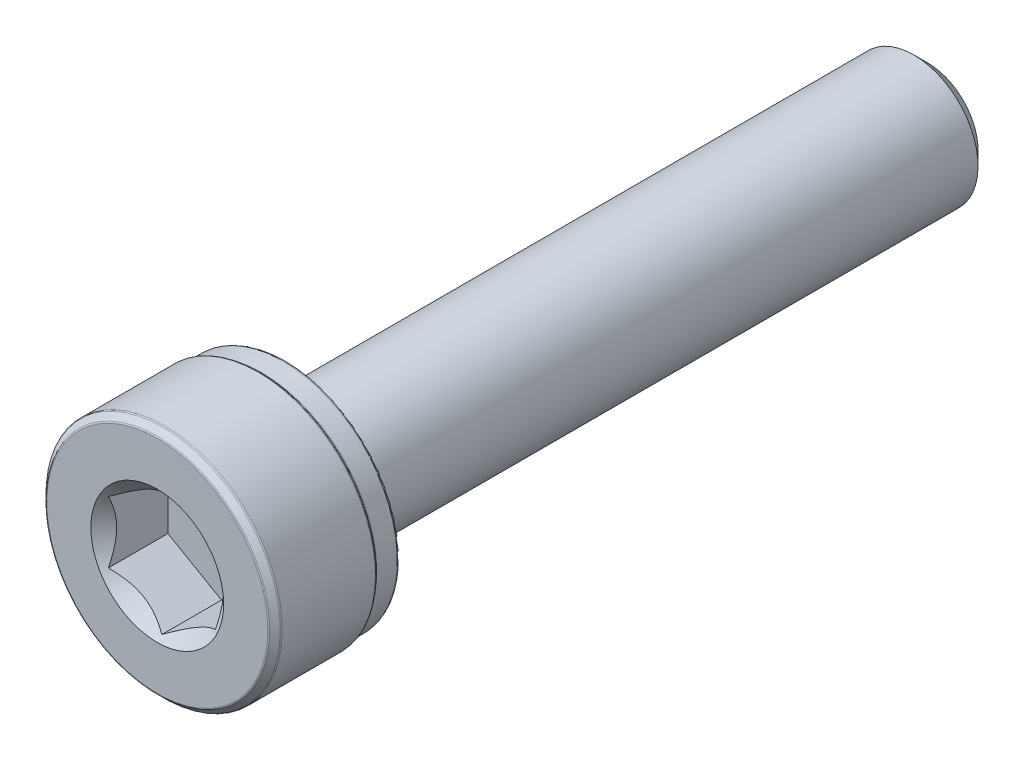
ISO-10303-21;
HEADER;
FILE_DESCRIPTION(('STEP AP214'),'2;1');
FILE_NAME('part.step','',(''),(''),'','','');
FILE_SCHEMA(('AUTOMOTIVE_DESIGN { 1 0 10303 214 1 1 1 1 }'));
ENDSEC;
DATA;
#1=APPLICATION_CONTEXT('core data for automotive mechanical design processes');
#2=APPLICATION_PROTOCOL_DEFINITION('international standard','automotive_design',2000,#1);
#3=PRODUCT_CONTEXT('',#1,'mechanical');
#4=PRODUCT('Part','Part','',(#3));
#5=PRODUCT_RELATED_PRODUCT_CATEGORY('part','',(#4));
#6=PRODUCT_DEFINITION_FORMATION('','',#4);
#7=PRODUCT_DEFINITION_CONTEXT('part definition',#1,'design');
#8=PRODUCT_DEFINITION('design','',#6,#7);
#9=PRODUCT_DEFINITION_SHAPE('','',#8);
#10=(LENGTH_UNIT() NAMED_UNIT(*) SI_UNIT(.MILLI.,.METRE.));
#11=(NAMED_UNIT(*) PLANE_ANGLE_UNIT() SI_UNIT($,.RADIAN.));
#12=(NAMED_UNIT(*) SI_UNIT($,.STERADIAN.) SOLID_ANGLE_UNIT());
#13=UNCERTAINTY_MEASURE_WITH_UNIT(LENGTH_MEASURE(1.E-05),#10,'distance_accuracy_value','');
#14=(GEOMETRIC_REPRESENTATION_CONTEXT(3) GLOBAL_UNCERTAINTY_ASSIGNED_CONTEXT((#13)) GLOBAL_UNIT_ASSIGNED_CONTEXT((#10,
#11,#12)) REPRESENTATION_CONTEXT('',''));
#15=CARTESIAN_POINT('',(0.,0.,0.));
#16=DIRECTION('',(0.,0.,1.));
#17=DIRECTION('',(1.,0.,0.));
#18=AXIS2_PLACEMENT_3D('',#15,#16,#17);
#19=CARTESIAN_POINT('',(0.,1.17524047358084,-9.));
#20=DIRECTION('',(0.,0.,-1.));
#21=DIRECTION('',(0.,1.,0.));
#22=AXIS2_PLACEMENT_3D('',#19,#20,#21);
#23=PLANE('',#22);
#24=CARTESIAN_POINT('',(0.,0.,-9.));
#25=DIRECTION('',(0.,0.,-1.));
#26=DIRECTION('',(0.,1.,0.));
#27=AXIS2_PLACEMENT_3D('',#24,#25,#26);
#28=CIRCLE('',#27,1.17524047358084);
#29=CARTESIAN_POINT('',(0.,1.17524047358084,-9.));
#30=VERTEX_POINT('',#29);
#31=EDGE_CURVE('E12',#30,#30,#28,.T.);
#32=ORIENTED_EDGE('',*,*,#31,.T.);
#33=EDGE_LOOP('',(#32));
#34=FACE_BOUND('',#33,.T.);
#35=ADVANCED_FACE('F35',(#34),#23,.T.);
#36=CARTESIAN_POINT('',(0.,0.,-9.));
#37=DIRECTION('',(0.,0.,1.));
#38=DIRECTION('',(0.,-1.,0.));
#39=AXIS2_PLACEMENT_3D('',#36,#37,#38);
#40=CONICAL_SURFACE('',#39,1.17524047358084,0.785398163397443);
#41=CARTESIAN_POINT('',(0.,0.,-8.67524047358084));
#42=DIRECTION('',(0.,0.,-1.));
#43=DIRECTION('',(0.,1.,0.));
#44=AXIS2_PLACEMENT_3D('',#41,#42,#43);
#45=CIRCLE('',#44,1.5);
#46=CARTESIAN_POINT('',(0.,1.5,-8.67524047358084));
#47=VERTEX_POINT('',#46);
#48=EDGE_CURVE('E42',#47,#47,#45,.T.);
#49=ORIENTED_EDGE('',*,*,#48,.T.);
#50=EDGE_LOOP('',(#49));
#51=FACE_BOUND('',#50,.T.);
#52=ORIENTED_EDGE('',*,*,#31,.F.);
#53=EDGE_LOOP('',(#52));
#54=FACE_BOUND('',#53,.T.);
#55=ADVANCED_FACE('F154',(#51,#54),#40,.T.);
#56=CARTESIAN_POINT('',(0.,0.,-9.));
#57=DIRECTION('',(0.,0.,-1.));
#58=DIRECTION('',(0.,1.,0.));
#59=AXIS2_PLACEMENT_3D('',#56,#57,#58);
#60=CYLINDRICAL_SURFACE('',#59,1.5);
#61=CARTESIAN_POINT('',(0.,0.,5.85));
#62=DIRECTION('',(0.,0.,-1.));
#63=DIRECTION('',(0.,1.,0.));
#64=AXIS2_PLACEMENT_3D('',#61,#62,#63);
#65=CIRCLE('',#64,1.5);
#66=CARTESIAN_POINT('',(0.,1.5,5.85));
#67=VERTEX_POINT('',#66);
#68=EDGE_CURVE('E149',#67,#67,#65,.T.);
#69=ORIENTED_EDGE('',*,*,#68,.T.);
#70=EDGE_LOOP('',(#69));
#71=FACE_BOUND('',#70,.T.);
#72=ORIENTED_EDGE('',*,*,#48,.F.);
#73=EDGE_LOOP('',(#72));
#74=FACE_BOUND('',#73,.T.);
#75=ADVANCED_FACE('F157',(#71,#74),#60,.T.);
#76=CARTESIAN_POINT('',(0.,0.,5.85));
#77=DIRECTION('',(0.,0.,-1.));
#78=DIRECTION('',(0.,1.,0.));
#79=AXIS2_PLACEMENT_3D('',#76,#77,#78);
#80=TOROIDAL_SURFACE('',#79,1.65,0.15);
#81=CARTESIAN_POINT('',(0.,0.,6.));
#82=DIRECTION('',(0.,0.,-1.));
#83=DIRECTION('',(0.,1.,0.));
#84=AXIS2_PLACEMENT_3D('',#81,#82,#83);
#85=CIRCLE('',#84,1.65);
#86=CARTESIAN_POINT('',(0.,1.65,6.));
#87=VERTEX_POINT('',#86);
#88=EDGE_CURVE('E146',#87,#87,#85,.T.);
#89=ORIENTED_EDGE('',*,*,#88,.T.);
#90=EDGE_LOOP('',(#89));
#91=FACE_BOUND('',#90,.T.);
#92=ORIENTED_EDGE('',*,*,#68,.F.);
#93=EDGE_LOOP('',(#92));
#94=FACE_BOUND('',#93,.T.);
#95=ADVANCED_FACE('F159',(#91,#94),#80,.F.);
#96=CARTESIAN_POINT('',(0.,2.60625,6.));
#97=DIRECTION('',(0.,0.,-1.));
#98=DIRECTION('',(0.,1.,0.));
#99=AXIS2_PLACEMENT_3D('',#96,#97,#98);
#100=PLANE('',#99);
#101=CARTESIAN_POINT('',(0.,0.,6.));
#102=DIRECTION('',(0.,0.,-1.));
#103=DIRECTION('',(0.,1.,0.));
#104=AXIS2_PLACEMENT_3D('',#101,#102,#103);
#105=CIRCLE('',#104,2.60625);
#106=CARTESIAN_POINT('',(0.,2.60625,6.));
#107=VERTEX_POINT('',#106);
#108=EDGE_CURVE('E143',#107,#107,#105,.T.);
#109=ORIENTED_EDGE('',*,*,#108,.T.);
#110=EDGE_LOOP('',(#109));
#111=FACE_BOUND('',#110,.T.);
#112=ORIENTED_EDGE('',*,*,#88,.F.);
#113=EDGE_LOOP('',(#112));
#114=FACE_BOUND('',#113,.T.);
#115=ADVANCED_FACE('F166',(#111,#114),#100,.T.);
#116=CARTESIAN_POINT('',(0.,0.,6.06875));
#117=DIRECTION('',(0.,0.,-1.));
#118=DIRECTION('',(0.,1.,0.));
#119=AXIS2_PLACEMENT_3D('',#116,#117,#118);
#120=TOROIDAL_SURFACE('',#119,2.60625,0.0687500000000002);
#121=CARTESIAN_POINT('',(0.,0.,6.06875));
#122=DIRECTION('',(0.,0.,-1.));
#123=DIRECTION('',(0.,1.,0.));
#124=AXIS2_PLACEMENT_3D('',#121,#122,#123);
#125=CIRCLE('',#124,2.675);
#126=CARTESIAN_POINT('',(0.,2.675,6.06875));
#127=VERTEX_POINT('',#126);
#128=EDGE_CURVE('E140',#127,#127,#125,.T.);
#129=ORIENTED_EDGE('',*,*,#128,.T.);
#130=EDGE_LOOP('',(#129));
#131=FACE_BOUND('',#130,.T.);
#132=ORIENTED_EDGE('',*,*,#108,.F.);
#133=EDGE_LOOP('',(#132));
#134=FACE_BOUND('',#133,.T.);
#135=ADVANCED_FACE('F197',(#131,#134),#120,.T.);
#136=CARTESIAN_POINT('',(0.,0.,-9.));
#137=DIRECTION('',(0.,0.,-1.));
#138=DIRECTION('',(0.,1.,0.));
#139=AXIS2_PLACEMENT_3D('',#136,#137,#138);
#140=CYLINDRICAL_SURFACE('',#139,2.675);
#141=CARTESIAN_POINT('',(0.,0.,6.54308373926376));
#142=DIRECTION('',(0.,0.,-1.));
#143=DIRECTION('',(0.,1.,0.));
#144=AXIS2_PLACEMENT_3D('',#141,#142,#143);
#145=CIRCLE('',#144,2.675);
#146=CARTESIAN_POINT('',(0.,2.675,6.54308373926376));
#147=VERTEX_POINT('',#146);
#148=EDGE_CURVE('E137',#147,#147,#145,.T.);
#149=ORIENTED_EDGE('',*,*,#148,.T.);
#150=EDGE_LOOP('',(#149));
#151=FACE_BOUND('',#150,.T.);
#152=ORIENTED_EDGE('',*,*,#128,.F.);
#153=EDGE_LOOP('',(#152));
#154=FACE_BOUND('',#153,.T.);
#155=ADVANCED_FACE('F207',(#151,#154),#140,.T.);
#156=CARTESIAN_POINT('',(0.,0.,6.54308373926376));
#157=DIRECTION('',(0.,0.,-1.));
#158=DIRECTION('',(0.,1.,0.));
#159=AXIS2_PLACEMENT_3D('',#156,#157,#158);
#160=TOROIDAL_SURFACE('',#159,2.721875,0.0468749999999996);
#161=CARTESIAN_POINT('',(0.,0.,6.57622936963188));
#162=DIRECTION('',(0.,0.,-1.));
#163=DIRECTION('',(0.,1.,0.));
#164=AXIS2_PLACEMENT_3D('',#161,#162,#163);
#165=CIRCLE('',#164,2.68872936963188);
#166=CARTESIAN_POINT('',(0.,2.68872936963188,6.57622936963188));
#167=VERTEX_POINT('',#166);
#168=EDGE_CURVE('E134',#167,#167,#165,.T.);
#169=ORIENTED_EDGE('',*,*,#168,.T.);
#170=EDGE_LOOP('',(#169));
#171=FACE_BOUND('',#170,.T.);
#172=ORIENTED_EDGE('',*,*,#148,.F.);
#173=EDGE_LOOP('',(#172));
#174=FACE_BOUND('',#173,.T.);
#175=ADVANCED_FACE('F217',(#171,#174),#160,.F.);
#176=CARTESIAN_POINT('',(0.,0.,6.57622936963188));
#177=DIRECTION('',(0.,0.,1.));
#178=DIRECTION('',(0.,-1.,0.));
#179=AXIS2_PLACEMENT_3D('',#176,#177,#178);
#180=CONICAL_SURFACE('',#179,2.68872936963188,0.785398163397435);
#181=CARTESIAN_POINT('',(0.,0.,6.62377063036812));
#182=DIRECTION('',(0.,0.,-1.));
#183=DIRECTION('',(0.,1.,0.));
#184=AXIS2_PLACEMENT_3D('',#181,#182,#183);
#185=CIRCLE('',#184,2.73627063036812);
#186=CARTESIAN_POINT('',(0.,2.73627063036812,6.62377063036812));
#187=VERTEX_POINT('',#186);
#188=EDGE_CURVE('E131',#187,#187,#185,.T.);
#189=ORIENTED_EDGE('',*,*,#188,.T.);
#190=EDGE_LOOP('',(#189));
#191=FACE_BOUND('',#190,.T.);
#192=ORIENTED_EDGE('',*,*,#168,.F.);
#193=EDGE_LOOP('',(#192));
#194=FACE_BOUND('',#193,.T.);
#195=ADVANCED_FACE('F227',(#191,#194),#180,.T.);
#196=CARTESIAN_POINT('',(0.,0.,6.65691626073624));
#197=DIRECTION('',(0.,0.,-1.));
#198=DIRECTION('',(0.,1.,0.));
#199=AXIS2_PLACEMENT_3D('',#196,#197,#198);
#200=TOROIDAL_SURFACE('',#199,2.703125,0.0468750000000018);
#201=CARTESIAN_POINT('',(0.,0.,6.65691626073624));
#202=DIRECTION('',(0.,0.,-1.));
#203=DIRECTION('',(0.,1.,0.));
#204=AXIS2_PLACEMENT_3D('',#201,#202,#203);
#205=CIRCLE('',#204,2.75);
#206=CARTESIAN_POINT('',(0.,2.75,6.65691626073624));
#207=VERTEX_POINT('',#206);
#208=EDGE_CURVE('E128',#207,#207,#205,.T.);
#209=ORIENTED_EDGE('',*,*,#208,.T.);
#210=EDGE_LOOP('',(#209));
#211=FACE_BOUND('',#210,.T.);
#212=ORIENTED_EDGE('',*,*,#188,.F.);
#213=EDGE_LOOP('',(#212));
#214=FACE_BOUND('',#213,.T.);
#215=ADVANCED_FACE('F237',(#211,#214),#200,.T.);
#216=CARTESIAN_POINT('',(0.,0.,-9.));
#217=DIRECTION('',(0.,0.,-1.));
#218=DIRECTION('',(0.,1.,0.));
#219=AXIS2_PLACEMENT_3D('',#216,#217,#218);
#220=CYLINDRICAL_SURFACE('',#219,2.75);
#221=CARTESIAN_POINT('',(0.,0.,8.83058373926377));
#222=DIRECTION('',(0.,0.,-1.));
#223=DIRECTION('',(0.,1.,0.));
#224=AXIS2_PLACEMENT_3D('',#221,#222,#223);
#225=CIRCLE('',#224,2.75);
#226=CARTESIAN_POINT('',(0.,2.75,8.83058373926377));
#227=VERTEX_POINT('',#226);
#228=EDGE_CURVE('E125',#227,#227,#225,.T.);
#229=ORIENTED_EDGE('',*,*,#228,.T.);
#230=EDGE_LOOP('',(#229));
#231=FACE_BOUND('',#230,.T.);
#232=ORIENTED_EDGE('',*,*,#208,.F.);
#233=EDGE_LOOP('',(#232));
#234=FACE_BOUND('',#233,.T.);
#235=ADVANCED_FACE('F247',(#231,#234),#220,.T.);
#236=CARTESIAN_POINT('',(0.,0.,8.83058373926377));
#237=DIRECTION('',(0.,0.,-1.));
#238=DIRECTION('',(0.,1.,0.));
#239=AXIS2_PLACEMENT_3D('',#236,#237,#238);
#240=TOROIDAL_SURFACE('',#239,2.703125,0.046874999999999);
#241=CARTESIAN_POINT('',(0.,0.,8.86372936963189));
#242=DIRECTION('',(0.,0.,-1.));
#243=DIRECTION('',(0.,1.,0.));
#244=AXIS2_PLACEMENT_3D('',#241,#242,#243);
#245=CIRCLE('',#244,2.73627063036812);
#246=CARTESIAN_POINT('',(0.,2.73627063036812,8.86372936963189));
#247=VERTEX_POINT('',#246);
#248=EDGE_CURVE('E122',#247,#247,#245,.T.);
#249=ORIENTED_EDGE('',*,*,#248,.T.);
#250=EDGE_LOOP('',(#249));
#251=FACE_BOUND('',#250,.T.);
#252=ORIENTED_EDGE('',*,*,#228,.F.);
#253=EDGE_LOOP('',(#252));
#254=FACE_BOUND('',#253,.T.);
#255=ADVANCED_FACE('F257',(#251,#254),#240,.T.);
#256=CARTESIAN_POINT('',(0.,0.,8.86372936963189));
#257=DIRECTION('',(0.,0.,-1.));
#258=DIRECTION('',(0.,1.,0.));
#259=AXIS2_PLACEMENT_3D('',#256,#257,#258);
#260=CONICAL_SURFACE('',#259,2.73627063036812,0.785398163397448);
#261=CARTESIAN_POINT('',(0.,0.,8.98627063036812));
#262=DIRECTION('',(0.,0.,-1.));
#263=DIRECTION('',(0.,1.,0.));
#264=AXIS2_PLACEMENT_3D('',#261,#262,#263);
#265=CIRCLE('',#264,2.61372936963188);
#266=CARTESIAN_POINT('',(0.,2.61372936963188,8.98627063036812));
#267=VERTEX_POINT('',#266);
#268=EDGE_CURVE('E119',#267,#267,#265,.T.);
#269=ORIENTED_EDGE('',*,*,#268,.T.);
#270=EDGE_LOOP('',(#269));
#271=FACE_BOUND('',#270,.T.);
#272=ORIENTED_EDGE('',*,*,#248,.F.);
#273=EDGE_LOOP('',(#272));
#274=FACE_BOUND('',#273,.T.);
#275=ADVANCED_FACE('F267',(#271,#274),#260,.T.);
#276=CARTESIAN_POINT('',(0.,0.,8.953125));
#277=DIRECTION('',(0.,0.,-1.));
#278=DIRECTION('',(0.,1.,0.));
#279=AXIS2_PLACEMENT_3D('',#276,#277,#278);
#280=TOROIDAL_SURFACE('',#279,2.58058373926377,0.0468749999999982);
#281=CARTESIAN_POINT('',(0.,0.,9.));
#282=DIRECTION('',(0.,0.,-1.));
#283=DIRECTION('',(0.,1.,0.));
#284=AXIS2_PLACEMENT_3D('',#281,#282,#283);
#285=CIRCLE('',#284,2.58058373926377);
#286=CARTESIAN_POINT('',(0.,2.58058373926377,9.));
#287=VERTEX_POINT('',#286);
#288=EDGE_CURVE('E116',#287,#287,#285,.T.);
#289=ORIENTED_EDGE('',*,*,#288,.T.);
#290=EDGE_LOOP('',(#289));
#291=FACE_BOUND('',#290,.T.);
#292=ORIENTED_EDGE('',*,*,#268,.F.);
#293=EDGE_LOOP('',(#292));
#294=FACE_BOUND('',#293,.T.);
#295=ADVANCED_FACE('F277',(#291,#294),#280,.T.);
#296=CARTESIAN_POINT('',(0.,0.,9.));
#297=DIRECTION('',(0.,0.,1.));
#298=DIRECTION('',(0.,-1.,0.));
#299=AXIS2_PLACEMENT_3D('',#296,#297,#298);
#300=PLANE('',#299);
#301=CARTESIAN_POINT('',(0.,0.,9.));
#302=DIRECTION('',(0.,0.,1.));
#303=DIRECTION('',(1.,0.,0.));
#304=AXIS2_PLACEMENT_3D('',#301,#302,#303);
#305=CIRCLE('',#304,1.55162884844711);
#306=CARTESIAN_POINT('',(1.55162884844711,0.,9.));
#307=VERTEX_POINT('',#306);
#308=EDGE_CURVE('E93',#307,#307,#305,.T.);
#309=ORIENTED_EDGE('',*,*,#308,.F.);
#310=EDGE_LOOP('',(#309));
#311=FACE_BOUND('',#310,.T.);
#312=ORIENTED_EDGE('',*,*,#288,.F.);
#313=EDGE_LOOP('',(#312));
#314=FACE_BOUND('',#313,.T.);
#315=ADVANCED_FACE('F287',(#311,#314),#300,.T.);
#316=CARTESIAN_POINT('',(0.,0.,9.));
#317=DIRECTION('',(0.,0.,1.));
#318=DIRECTION('',(1.,0.,0.));
#319=AXIS2_PLACEMENT_3D('',#316,#317,#318);
#320=CONICAL_SURFACE('',#319,1.55162884844711,0.78539816339745);
#321=ORIENTED_EDGE('',*,*,#308,.T.);
#322=EDGE_LOOP('',(#321));
#323=FACE_BOUND('',#322,.T.);
#324=CARTESIAN_POINT('',(-1.25019999999999,-0.721572366433193,8.89186230843608));
#325=CARTESIAN_POINT('',(-1.20722483292841,-0.746384090710443,8.86706849258205));
#326=CARTESIAN_POINT('',(-1.16353099525405,-0.771610739653663,8.84373055894563));
#327=CARTESIAN_POINT('',(-1.07443406915805,-0.823050873919153,8.80099882861148));
#328=CARTESIAN_POINT('',(-1.02902250164293,-0.849269254648331,8.78162881688736));
#329=CARTESIAN_POINT('',(-0.937452179064736,-0.902137405038633,8.74844730794043));
#330=CARTESIAN_POINT('',(-0.89131675982411,-0.928773701756385,8.7345523835796));
#331=CARTESIAN_POINT('',(-0.798029919592404,-0.98263288407601,8.71314410668759));
#332=CARTESIAN_POINT('',(-0.750881350863617,-1.00985412292348,8.70561476609373));
#333=CARTESIAN_POINT('',(-0.669626443112745,-1.05676666578642,8.69882132257765));
#334=CARTESIAN_POINT('',(-0.635625123372056,-1.07639733689151,8.6978153836313));
#335=CARTESIAN_POINT('',(-0.56768223556752,-1.11562418145498,8.69950823943827));
#336=CARTESIAN_POINT('',(-0.53374068234434,-1.1352203463451,8.70220785174249));
#337=CARTESIAN_POINT('',(-0.466185143542499,-1.17422355485759,8.71115575484333));
#338=CARTESIAN_POINT('',(-0.432571492713223,-1.19363040521232,8.71740735042665));
#339=CARTESIAN_POINT('',(-0.365905361782185,-1.23212011385119,8.73312250594085));
#340=CARTESIAN_POINT('',(-0.332853128969703,-1.25120282936279,8.74258744461441));
#341=CARTESIAN_POINT('',(-0.248200308399734,-1.30007715810652,8.77067821521453));
#342=CARTESIAN_POINT('',(-0.197133507570361,-1.32956058931202,8.79141698197915));
#343=CARTESIAN_POINT('',(-0.0969991458867448,-1.38737318998518,8.83813395919842));
#344=CARTESIAN_POINT('',(-0.0479256884217304,-1.41570576386268,8.86409512047372));
#345=CARTESIAN_POINT('',(0.000199999999999961,-1.4434911430279,8.89186230843608));
#346=B_SPLINE_CURVE_WITH_KNOTS('',3,(#324,#325,#326,#327,#328,#329,#330,#331,#332,#333,#334,
#335,#336,#337,#338,#339,#340,#341,#342,#343,#344,#345),.UNSPECIFIED.,.F.,.F.,(4,2,2,2,2,2,2,2,
2,2,4),(0.,0.166533409618303,0.33403760728976,0.498880396489695,0.663307919240271,
0.780963963458822,0.898645970148448,1.01643764860773,1.13427993171549,1.3214865203214,
1.50809158792573),.UNSPECIFIED.);
#347=CARTESIAN_POINT('',(-1.24999999999999,-0.721687836487031,8.89174682452695));
#348=VERTEX_POINT('',#347);
#349=CARTESIAN_POINT('',(0.,-1.44337567297406,8.89174682452695));
#350=VERTEX_POINT('',#349);
#351=EDGE_CURVE('E100',#348,#350,#346,.T.);
#352=ORIENTED_EDGE('',*,*,#351,.F.);
#353=CARTESIAN_POINT('',(-1.24999999999999,-1.52022146239344,9.41651070319084));
#354=CARTESIAN_POINT('',(-1.24999999999999,-1.48354689134962,9.38818689718723));
#355=CARTESIAN_POINT('',(-1.24999999999999,-1.44667707589304,9.36011672093047));
#356=CARTESIAN_POINT('',(-1.24999999999999,-1.37246477804769,9.30459065501776));
#357=CARTESIAN_POINT('',(-1.24999999999999,-1.33512218721452,9.27713491044788));
#358=CARTESIAN_POINT('',(-1.24999999999999,-1.22171630832113,9.1954580977105));
#359=CARTESIAN_POINT('',(-1.24999999999999,-1.14482995781091,9.1423614251193));
#360=CARTESIAN_POINT('',(-1.24999999999999,-0.983056768942583,9.03734973416941));
#361=CARTESIAN_POINT('',(-1.24999999999999,-0.897974111811053,8.98573326925832));
#362=CARTESIAN_POINT('',(-1.24999999999999,-0.723462355215553,8.89078355108508));
#363=CARTESIAN_POINT('',(-1.24999999999999,-0.634049271919703,8.84742232185916));
#364=CARTESIAN_POINT('',(-1.24999999999999,-0.500588771143697,8.79435177040725));
#365=CARTESIAN_POINT('',(-1.24999999999999,-0.458691726208108,8.77926501327173));
#366=CARTESIAN_POINT('',(-1.24999999999999,-0.373815329706777,8.75244749770266));
#367=CARTESIAN_POINT('',(-1.24999999999999,-0.330835910419722,8.74071694982871));
#368=CARTESIAN_POINT('',(-1.24999999999999,-0.244810833071147,8.72144313304601));
#369=CARTESIAN_POINT('',(-1.24999999999999,-0.20178270746757,8.71382289169454));
#370=CARTESIAN_POINT('',(-1.24999999999999,-0.115176247984995,8.70293190707963));
#371=CARTESIAN_POINT('',(-1.24999999999999,-0.0715980347745601,8.69966022608571));
#372=CARTESIAN_POINT('',(-1.24999999999999,0.0136806197531957,8.69775210045869));
#373=CARTESIAN_POINT('',(-1.24999999999999,0.0553765370047036,8.69891205716704));
#374=CARTESIAN_POINT('',(-1.24999999999999,0.138449096453158,8.70533266388464));
#375=CARTESIAN_POINT('',(-1.24999999999999,0.17982570978194,8.71059368038276));
#376=CARTESIAN_POINT('',(-1.24999999999999,0.262662840763596,8.72500574721218));
#377=CARTESIAN_POINT('',(-1.24999999999999,0.304111120669648,8.73422600730023));
#378=CARTESIAN_POINT('',(-1.24999999999999,0.386089884230831,8.75604235623938));
#379=CARTESIAN_POINT('',(-1.24999999999999,0.426620414510366,8.76863827317793));
#380=CARTESIAN_POINT('',(-1.24999999999999,0.550794781768358,8.81205959164791));
#381=CARTESIAN_POINT('',(-1.25,0.632755591043408,8.84768282700966));
#382=CARTESIAN_POINT('',(-1.25,0.792852508946377,8.92696814455954));
#383=CARTESIAN_POINT('',(-1.25,0.870973935410869,8.97065844211049));
#384=CARTESIAN_POINT('',(-1.25,1.02031328199645,9.06088158787621));
#385=CARTESIAN_POINT('',(-1.25,1.09168171050214,9.10716845879521));
#386=CARTESIAN_POINT('',(-1.25,1.19682802849917,9.17876149953673));
#387=CARTESIAN_POINT('',(-1.25,1.23142482143589,9.20288582787532));
#388=CARTESIAN_POINT('',(-1.25,1.30014350643267,9.25178258410313));
#389=CARTESIAN_POINT('',(-1.25,1.3342655268045,9.2765548314612));
#390=CARTESIAN_POINT('',(-1.25,1.36818950249275,9.3015960474388));
#391=B_SPLINE_CURVE_WITH_KNOTS('',3,(#353,#354,#355,#356,#357,#358,#359,#360,#361,#362,#363,
#364,#365,#366,#367,#368,#369,#370,#371,#372,#373,#374,#375,#376,#377,#378,#379,#380,#381,#382,
#383,#384,#385,#386,#387,#388,#389,#390),.UNSPECIFIED.,.F.,.F.,(4,2,2,2,2,2,2,2,2,2,2,2,2,2,2,2,
2,2,4),(0.,0.139012369615044,0.278057225136918,0.55825950405377,0.856585057342472,
1.15388088887298,1.28736138903991,1.42085026158167,1.55174393609413,1.68260937990423,
1.80753647715251,1.93247473971975,2.05969207441602,2.18690293152763,2.45422704655831,
2.72250450232037,2.97756898823761,3.10409578574713,3.23058769667825),.UNSPECIFIED.);
#392=CARTESIAN_POINT('',(-1.25,0.72168783648703,8.89174682452695));
#393=VERTEX_POINT('',#392);
#394=EDGE_CURVE('E411',#393,#348,#391,.F.);
#395=ORIENTED_EDGE('',*,*,#394,.F.);
#396=CARTESIAN_POINT('',(0.000200000000002876,1.4434911430279,8.89186230843609));
#397=CARTESIAN_POINT('',(-0.0427751670715841,1.41867941875065,8.86706849258205));
#398=CARTESIAN_POINT('',(-0.0864690047459454,1.39345276980743,8.84373055894563));
#399=CARTESIAN_POINT('',(-0.175565930841939,1.34201263554194,8.80099882861149));
#400=CARTESIAN_POINT('',(-0.220977498357061,1.31579425481276,8.78162881688736));
#401=CARTESIAN_POINT('',(-0.312547820935256,1.26292610442246,8.74844730794043));
#402=CARTESIAN_POINT('',(-0.358683240175882,1.23628980770471,8.7345523835796));
#403=CARTESIAN_POINT('',(-0.451970080407589,1.18243062538508,8.71314410668759));
#404=CARTESIAN_POINT('',(-0.499118649136376,1.15520938653761,8.70561476609373));
#405=CARTESIAN_POINT('',(-0.580373556887248,1.10829684367467,8.69882132257765));
#406=CARTESIAN_POINT('',(-0.614374876627937,1.08866617256958,8.6978153836313));
#407=CARTESIAN_POINT('',(-0.682317764432473,1.04943932800611,8.69950823943827));
#408=CARTESIAN_POINT('',(-0.716259317655653,1.02984316311599,8.70220785174249));
#409=CARTESIAN_POINT('',(-0.783814856457495,0.990839954603497,8.71115575484333));
#410=CARTESIAN_POINT('',(-0.81742850728677,0.971433104248769,8.71740735042665));
#411=CARTESIAN_POINT('',(-0.884094638217808,0.932943395609903,8.73312250594085));
#412=CARTESIAN_POINT('',(-0.91714687103029,0.913860680098298,8.74258744461441));
#413=CARTESIAN_POINT('',(-1.00179969160026,0.864986351354566,8.77067821521453));
#414=CARTESIAN_POINT('',(-1.05286649242963,0.835502920149074,8.79141698197915));
#415=CARTESIAN_POINT('',(-1.15300085411325,0.777690319475906,8.83813395919842));
#416=CARTESIAN_POINT('',(-1.20207431157826,0.749357745598414,8.86409512047371));
#417=CARTESIAN_POINT('',(-1.25019999999999,0.721572366433192,8.89186230843608));
#418=B_SPLINE_CURVE_WITH_KNOTS('',3,(#396,#397,#398,#399,#400,#401,#402,#403,#404,#405,#406,
#407,#408,#409,#410,#411,#412,#413,#414,#415,#416,#417),.UNSPECIFIED.,.F.,.F.,(4,2,2,2,2,2,2,2,
2,2,4),(0.,0.166533409618304,0.334037607289761,0.498880396489697,0.663307919240273,
0.780963963458825,0.898645970148451,1.01643764860773,1.13427993171549,1.32148652032141,
1.50809158792573),.UNSPECIFIED.);
#419=CARTESIAN_POINT('',(0.,1.44337567297406,8.89174682452695));
#420=VERTEX_POINT('',#419);
#421=EDGE_CURVE('E406',#420,#393,#418,.T.);
#422=ORIENTED_EDGE('',*,*,#421,.F.);
#423=CARTESIAN_POINT('',(1.2502,0.721572366433193,8.89186230843609));
#424=CARTESIAN_POINT('',(1.20722483292841,0.746384090710443,8.86706849258205));
#425=CARTESIAN_POINT('',(1.16353099525405,0.771610739653663,8.84373055894564));
#426=CARTESIAN_POINT('',(1.07443406915806,0.823050873919153,8.80099882861149));
#427=CARTESIAN_POINT('',(1.02902250164294,0.849269254648332,8.78162881688737));
#428=CARTESIAN_POINT('',(0.937452179064739,0.902137405038634,8.74844730794043));
#429=CARTESIAN_POINT('',(0.891316759824113,0.928773701756386,8.73455238357961));
#430=CARTESIAN_POINT('',(0.798029919592406,0.982632884076011,8.71314410668759));
#431=CARTESIAN_POINT('',(0.750881350863619,1.00985412292348,8.70561476609374));
#432=CARTESIAN_POINT('',(0.669626443112746,1.05676666578643,8.69882132257765));
#433=CARTESIAN_POINT('',(0.635625123372057,1.07639733689152,8.6978153836313));
#434=CARTESIAN_POINT('',(0.567682235567521,1.11562418145499,8.69950823943827));
#435=CARTESIAN_POINT('',(0.533740682344341,1.1352203463451,8.70220785174249));
#436=CARTESIAN_POINT('',(0.466185143542499,1.1742235548576,8.71115575484333));
#437=CARTESIAN_POINT('',(0.432571492713224,1.19363040521232,8.71740735042666));
#438=CARTESIAN_POINT('',(0.365905361782186,1.23212011385119,8.73312250594086));
#439=CARTESIAN_POINT('',(0.332853128969703,1.25120282936279,8.74258744461441));
#440=CARTESIAN_POINT('',(0.248200308399735,1.30007715810653,8.77067821521454));
#441=CARTESIAN_POINT('',(0.197133507570362,1.32956058931202,8.79141698197915));
#442=CARTESIAN_POINT('',(0.0969991458867467,1.38737318998518,8.83813395919843));
#443=CARTESIAN_POINT('',(0.0479256884217327,1.41570576386268,8.86409512047372));
#444=CARTESIAN_POINT('',(-0.000199999999997462,1.4434911430279,8.89186230843609));
#445=B_SPLINE_CURVE_WITH_KNOTS('',3,(#423,#424,#425,#426,#427,#428,#429,#430,#431,#432,#433,
#434,#435,#436,#437,#438,#439,#440,#441,#442,#443,#444),.UNSPECIFIED.,.F.,.F.,(4,2,2,2,2,2,2,2,
2,2,4),(0.,0.166533409618305,0.334037607289763,0.4988803964897,0.663307919240277,
0.780963963458829,0.898645970148455,1.01643764860773,1.1342799317155,1.32148652032141,
1.50809158792573),.UNSPECIFIED.);
#446=CARTESIAN_POINT('',(1.25,0.721687836487031,8.89174682452695));
#447=VERTEX_POINT('',#446);
#448=EDGE_CURVE('E49',#447,#420,#445,.T.);
#449=ORIENTED_EDGE('',*,*,#448,.F.);
#450=CARTESIAN_POINT('',(1.25,-1.52022146239343,9.41651070319084));
#451=CARTESIAN_POINT('',(1.25,-1.4835468913496,9.38818689718723));
#452=CARTESIAN_POINT('',(1.25,-1.44667707589303,9.36011672093046));
#453=CARTESIAN_POINT('',(1.25,-1.37246477804768,9.30459065501776));
#454=CARTESIAN_POINT('',(1.25,-1.33512218721451,9.27713491044787));
#455=CARTESIAN_POINT('',(1.25,-1.22171630832112,9.19545809771049));
#456=CARTESIAN_POINT('',(1.25,-1.1448299578109,9.1423614251193));
#457=CARTESIAN_POINT('',(1.25,-0.983056768942574,9.03734973416941));
#458=CARTESIAN_POINT('',(1.25,-0.897974111811044,8.98573326925832));
#459=CARTESIAN_POINT('',(1.25,-0.723462355215546,8.89078355108508));
#460=CARTESIAN_POINT('',(1.25,-0.634049271919697,8.84742232185916));
#461=CARTESIAN_POINT('',(1.25,-0.500588771143692,8.79435177040725));
#462=CARTESIAN_POINT('',(1.25,-0.458691726208103,8.77926501327174));
#463=CARTESIAN_POINT('',(1.25,-0.373815329706772,8.75244749770266));
#464=CARTESIAN_POINT('',(1.25,-0.330835910419717,8.74071694982872));
#465=CARTESIAN_POINT('',(1.25,-0.244810833071143,8.72144313304602));
#466=CARTESIAN_POINT('',(1.25,-0.201782707467565,8.71382289169454));
#467=CARTESIAN_POINT('',(1.25,-0.11517624798499,8.70293190707963));
#468=CARTESIAN_POINT('',(1.25,-0.0715980347745554,8.69966022608571));
#469=CARTESIAN_POINT('',(1.25,0.0136806197532003,8.6977521004587));
#470=CARTESIAN_POINT('',(1.25,0.0553765370047082,8.69891205716705));
#471=CARTESIAN_POINT('',(1.25,0.138449096453163,8.70533266388465));
#472=CARTESIAN_POINT('',(1.25,0.179825709781945,8.71059368038276));
#473=CARTESIAN_POINT('',(1.25,0.2626628407636,8.72500574721218));
#474=CARTESIAN_POINT('',(1.25,0.304111120669653,8.73422600730024));
#475=CARTESIAN_POINT('',(1.25,0.386089884230835,8.75604235623939));
#476=CARTESIAN_POINT('',(1.25,0.42662041451037,8.76863827317793));
#477=CARTESIAN_POINT('',(1.25,0.550794781768363,8.81205959164791));
#478=CARTESIAN_POINT('',(1.25,0.632755591043413,8.84768282700967));
#479=CARTESIAN_POINT('',(1.25,0.792852508946383,8.92696814455954));
#480=CARTESIAN_POINT('',(1.25,0.870973935410877,8.9706584421105));
#481=CARTESIAN_POINT('',(1.25,1.02031328199646,9.06088158787622));
#482=CARTESIAN_POINT('',(1.25,1.09168171050215,9.10716845879522));
#483=CARTESIAN_POINT('',(1.25,1.19682802849918,9.17876149953674));
#484=CARTESIAN_POINT('',(1.25,1.2314248214359,9.20288582787533));
#485=CARTESIAN_POINT('',(1.25,1.30014350643268,9.25178258410314));
#486=CARTESIAN_POINT('',(1.25,1.33426552680452,9.27655483146121));
#487=CARTESIAN_POINT('',(1.25,1.36818950249276,9.30159604743881));
#488=B_SPLINE_CURVE_WITH_KNOTS('',3,(#450,#451,#452,#453,#454,#455,#456,#457,#458,#459,#460,
#461,#462,#463,#464,#465,#466,#467,#468,#469,#470,#471,#472,#473,#474,#475,#476,#477,#478,#479,
#480,#481,#482,#483,#484,#485,#486,#487),.UNSPECIFIED.,.F.,.F.,(4,2,2,2,2,2,2,2,2,2,2,2,2,2,2,2,
2,2,4),(0.,0.139012369615044,0.278057225136916,0.558259504053765,0.856585057342465,
1.15388088887297,1.2873613890399,1.42085026158166,1.55174393609412,1.68260937990422,
1.8075364771525,1.93247473971973,2.05969207441601,2.18690293152762,2.4542270465583,
2.72250450232037,2.9775689882376,3.10409578574712,3.23058769667825),.UNSPECIFIED.);
#489=CARTESIAN_POINT('',(1.25,-0.721687836487027,8.89174682452695));
#490=VERTEX_POINT('',#489);
#491=EDGE_CURVE('E86',#490,#447,#488,.T.);
#492=ORIENTED_EDGE('',*,*,#491,.F.);
#493=CARTESIAN_POINT('',(-0.000200000000000067,-1.4434911430279,8.89186230843608));
#494=CARTESIAN_POINT('',(0.0427751670715864,-1.41867941875065,8.86706849258205));
#495=CARTESIAN_POINT('',(0.0864690047459477,-1.39345276980743,8.84373055894563));
#496=CARTESIAN_POINT('',(0.175565930841941,-1.34201263554194,8.80099882861149));
#497=CARTESIAN_POINT('',(0.220977498357064,-1.31579425481276,8.78162881688736));
#498=CARTESIAN_POINT('',(0.312547820935259,-1.26292610442246,8.74844730794043));
#499=CARTESIAN_POINT('',(0.358683240175885,-1.23628980770471,8.7345523835796));
#500=CARTESIAN_POINT('',(0.451970080407592,-1.18243062538508,8.71314410668759));
#501=CARTESIAN_POINT('',(0.499118649136379,-1.15520938653761,8.70561476609373));
#502=CARTESIAN_POINT('',(0.580373556887251,-1.10829684367466,8.69882132257765));
#503=CARTESIAN_POINT('',(0.61437487662794,-1.08866617256958,8.6978153836313));
#504=CARTESIAN_POINT('',(0.682317764432476,-1.04943932800611,8.69950823943827));
#505=CARTESIAN_POINT('',(0.716259317655656,-1.02984316311599,8.70220785174249));
#506=CARTESIAN_POINT('',(0.783814856457497,-0.990839954603495,8.71115575484333));
#507=CARTESIAN_POINT('',(0.817428507286773,-0.971433104248767,8.71740735042665));
#508=CARTESIAN_POINT('',(0.884094638217811,-0.932943395609901,8.73312250594085));
#509=CARTESIAN_POINT('',(0.917146871030293,-0.913860680098297,8.74258744461441));
#510=CARTESIAN_POINT('',(1.00179969160026,-0.864986351354564,8.77067821521453));
#511=CARTESIAN_POINT('',(1.05286649242964,-0.835502920149071,8.79141698197915));
#512=CARTESIAN_POINT('',(1.15300085411325,-0.777690319475903,8.83813395919842));
#513=CARTESIAN_POINT('',(1.20207431157827,-0.749357745598411,8.86409512047372));
#514=CARTESIAN_POINT('',(1.2502,-0.721572366433189,8.89186230843609));
#515=B_SPLINE_CURVE_WITH_KNOTS('',3,(#493,#494,#495,#496,#497,#498,#499,#500,#501,#502,#503,
#504,#505,#506,#507,#508,#509,#510,#511,#512,#513,#514),.UNSPECIFIED.,.F.,.F.,(4,2,2,2,2,2,2,2,
2,2,4),(0.,0.166533409618303,0.334037607289761,0.498880396489697,0.663307919240273,
0.780963963458825,0.898645970148451,1.01643764860773,1.13427993171549,1.32148652032141,
1.50809158792574),.UNSPECIFIED.);
#516=EDGE_CURVE('E89',#350,#490,#515,.T.);
#517=ORIENTED_EDGE('',*,*,#516,.F.);
#518=EDGE_LOOP('',(#352,#395,#422,#449,#492,#517));
#519=FACE_BOUND('',#518,.T.);
#520=ADVANCED_FACE('F88',(#323,#519),#320,.F.);
#521=CARTESIAN_POINT('',(0.,0.,7.5));
#522=DIRECTION('',(0.,0.,1.));
#523=DIRECTION('',(1.,0.,0.));
#524=AXIS2_PLACEMENT_3D('',#521,#522,#523);
#525=PLANE('',#524);
#526=DIRECTION('',(0.866025403784439,0.5,0.));
#527=VECTOR('',#526,1.);
#528=CARTESIAN_POINT('',(0.,-1.44337567297406,7.5));
#529=LINE('',#528,#527);
#530=CARTESIAN_POINT('',(0.,-1.44337567297406,7.5));
#531=VERTEX_POINT('',#530);
#532=CARTESIAN_POINT('',(1.25,-0.721687836487027,7.5));
#533=VERTEX_POINT('',#532);
#534=EDGE_CURVE('E99',#531,#533,#529,.T.);
#535=ORIENTED_EDGE('',*,*,#534,.T.);
#536=DIRECTION('',(0.,1.,0.));
#537=VECTOR('',#536,1.);
#538=CARTESIAN_POINT('',(1.25,-0.721687836487027,7.5));
#539=LINE('',#538,#537);
#540=CARTESIAN_POINT('',(1.25,0.721687836487031,7.5));
#541=VERTEX_POINT('',#540);
#542=EDGE_CURVE('E104',#533,#541,#539,.T.);
#543=ORIENTED_EDGE('',*,*,#542,.T.);
#544=DIRECTION('',(-0.866025403784439,0.499999999999999,0.));
#545=VECTOR('',#544,1.);
#546=CARTESIAN_POINT('',(1.25,0.721687836487031,7.5));
#547=LINE('',#546,#545);
#548=CARTESIAN_POINT('',(0.,1.44337567297406,7.5));
#549=VERTEX_POINT('',#548);
#550=EDGE_CURVE('E439',#541,#549,#547,.T.);
#551=ORIENTED_EDGE('',*,*,#550,.T.);
#552=DIRECTION('',(-0.866025403784439,-0.5,0.));
#553=VECTOR('',#552,1.);
#554=CARTESIAN_POINT('',(0.,1.44337567297406,7.5));
#555=LINE('',#554,#553);
#556=CARTESIAN_POINT('',(-1.25,0.72168783648703,7.5));
#557=VERTEX_POINT('',#556);
#558=EDGE_CURVE('E428',#549,#557,#555,.T.);
#559=ORIENTED_EDGE('',*,*,#558,.T.);
#560=DIRECTION('',(0.,-1.,0.));
#561=VECTOR('',#560,1.);
#562=CARTESIAN_POINT('',(-1.25,0.72168783648703,7.5));
#563=LINE('',#562,#561);
#564=CARTESIAN_POINT('',(-1.24999999999999,-0.721687836487031,7.5));
#565=VERTEX_POINT('',#564);
#566=EDGE_CURVE('E112',#557,#565,#563,.T.);
#567=ORIENTED_EDGE('',*,*,#566,.T.);
#568=DIRECTION('',(0.866025403784439,-0.5,0.));
#569=VECTOR('',#568,1.);
#570=CARTESIAN_POINT('',(-1.24999999999999,-0.721687836487031,7.5));
#571=LINE('',#570,#569);
#572=EDGE_CURVE('E107',#565,#531,#571,.T.);
#573=ORIENTED_EDGE('',*,*,#572,.T.);
#574=EDGE_LOOP('',(#535,#543,#551,#559,#567,#573));
#575=FACE_BOUND('',#574,.T.);
#576=ADVANCED_FACE('F307',(#575),#525,.T.);
#577=CARTESIAN_POINT('',(1.25,-0.721687836487027,7.5));
#578=DIRECTION('',(1.,0.,0.));
#579=DIRECTION('',(0.,0.,-1.));
#580=AXIS2_PLACEMENT_3D('',#577,#578,#579);
#581=PLANE('',#580);
#582=DIRECTION('',(0.,0.,1.));
#583=VECTOR('',#582,1.);
#584=CARTESIAN_POINT('',(1.25,-0.721687836487027,7.5));
#585=LINE('',#584,#583);
#586=EDGE_CURVE('E97',#533,#490,#585,.T.);
#587=ORIENTED_EDGE('',*,*,#586,.T.);
#588=ORIENTED_EDGE('',*,*,#491,.T.);
#589=DIRECTION('',(0.,0.,1.));
#590=VECTOR('',#589,1.);
#591=CARTESIAN_POINT('',(1.25,0.721687836487031,7.5));
#592=LINE('',#591,#590);
#593=EDGE_CURVE('E106',#541,#447,#592,.T.);
#594=ORIENTED_EDGE('',*,*,#593,.F.);
#595=ORIENTED_EDGE('',*,*,#542,.F.);
#596=EDGE_LOOP('',(#587,#588,#594,#595));
#597=FACE_BOUND('',#596,.T.);
#598=ADVANCED_FACE('F102',(#597),#581,.F.);
#599=CARTESIAN_POINT('',(1.25,0.721687836487031,7.5));
#600=DIRECTION('',(0.499999999999999,0.866025403784439,0.));
#601=DIRECTION('',(-0.866025403784439,0.499999999999999,0.));
#602=AXIS2_PLACEMENT_3D('',#599,#600,#601);
#603=PLANE('',#602);
#604=ORIENTED_EDGE('',*,*,#593,.T.);
#605=ORIENTED_EDGE('',*,*,#448,.T.);
#606=DIRECTION('',(0.,0.,1.));
#607=VECTOR('',#606,1.);
#608=CARTESIAN_POINT('',(0.,1.44337567297406,7.5));
#609=LINE('',#608,#607);
#610=EDGE_CURVE('E109',#549,#420,#609,.T.);
#611=ORIENTED_EDGE('',*,*,#610,.F.);
#612=ORIENTED_EDGE('',*,*,#550,.F.);
#613=EDGE_LOOP('',(#604,#605,#611,#612));
#614=FACE_BOUND('',#613,.T.);
#615=ADVANCED_FACE('F326',(#614),#603,.F.);
#616=CARTESIAN_POINT('',(0.,1.44337567297406,7.5));
#617=DIRECTION('',(-0.5,0.866025403784439,0.));
#618=DIRECTION('',(-0.866025403784439,-0.5,0.));
#619=AXIS2_PLACEMENT_3D('',#616,#617,#618);
#620=PLANE('',#619);
#621=ORIENTED_EDGE('',*,*,#610,.T.);
#622=ORIENTED_EDGE('',*,*,#421,.T.);
#623=DIRECTION('',(0.,0.,1.));
#624=VECTOR('',#623,1.);
#625=CARTESIAN_POINT('',(-1.25,0.72168783648703,7.5));
#626=LINE('',#625,#624);
#627=EDGE_CURVE('E430',#557,#393,#626,.T.);
#628=ORIENTED_EDGE('',*,*,#627,.F.);
#629=ORIENTED_EDGE('',*,*,#558,.F.);
#630=EDGE_LOOP('',(#621,#622,#628,#629));
#631=FACE_BOUND('',#630,.T.);
#632=ADVANCED_FACE('F335',(#631),#620,.F.);
#633=CARTESIAN_POINT('',(-1.25,0.72168783648703,7.5));
#634=DIRECTION('',(-1.,0.,0.));
#635=DIRECTION('',(0.,-1.,0.));
#636=AXIS2_PLACEMENT_3D('',#633,#634,#635);
#637=PLANE('',#636);
#638=ORIENTED_EDGE('',*,*,#627,.T.);
#639=ORIENTED_EDGE('',*,*,#394,.T.);
#640=DIRECTION('',(0.,0.,1.));
#641=VECTOR('',#640,1.);
#642=CARTESIAN_POINT('',(-1.24999999999999,-0.721687836487031,7.5));
#643=LINE('',#642,#641);
#644=EDGE_CURVE('E431',#565,#348,#643,.T.);
#645=ORIENTED_EDGE('',*,*,#644,.F.);
#646=ORIENTED_EDGE('',*,*,#566,.F.);
#647=EDGE_LOOP('',(#638,#639,#645,#646));
#648=FACE_BOUND('',#647,.T.);
#649=ADVANCED_FACE('F345',(#648),#637,.F.);
#650=CARTESIAN_POINT('',(-1.24999999999999,-0.721687836487031,7.5));
#651=DIRECTION('',(-0.5,-0.866025403784439,0.));
#652=DIRECTION('',(0.866025403784439,-0.5,0.));
#653=AXIS2_PLACEMENT_3D('',#650,#651,#652);
#654=PLANE('',#653);
#655=ORIENTED_EDGE('',*,*,#644,.T.);
#656=ORIENTED_EDGE('',*,*,#351,.T.);
#657=DIRECTION('',(0.,0.,1.));
#658=VECTOR('',#657,1.);
#659=CARTESIAN_POINT('',(0.,-1.44337567297406,7.5));
#660=LINE('',#659,#658);
#661=EDGE_CURVE('E57',#531,#350,#660,.T.);
#662=ORIENTED_EDGE('',*,*,#661,.F.);
#663=ORIENTED_EDGE('',*,*,#572,.F.);
#664=EDGE_LOOP('',(#655,#656,#662,#663));
#665=FACE_BOUND('',#664,.T.);
#666=ADVANCED_FACE('F355',(#665),#654,.F.);
#667=CARTESIAN_POINT('',(0.,-1.44337567297406,7.5));
#668=DIRECTION('',(0.5,-0.866025403784439,0.));
#669=DIRECTION('',(0.866025403784439,0.5,0.));
#670=AXIS2_PLACEMENT_3D('',#667,#668,#669);
#671=PLANE('',#670);
#672=ORIENTED_EDGE('',*,*,#661,.T.);
#673=ORIENTED_EDGE('',*,*,#516,.T.);
#674=ORIENTED_EDGE('',*,*,#586,.F.);
#675=ORIENTED_EDGE('',*,*,#534,.F.);
#676=EDGE_LOOP('',(#672,#673,#674,#675));
#677=FACE_BOUND('',#676,.T.);
#678=ADVANCED_FACE('F96',(#677),#671,.F.);
#679=CLOSED_SHELL('',(#35,#55,#75,#95,#115,#135,#155,#175,#195,#215,#235,#255,#275,#295,#315,
#520,#576,#598,#615,#632,#649,#666,#678));
#680=MANIFOLD_SOLID_BREP('B2',#679);
#681=ADVANCED_BREP_SHAPE_REPRESENTATION('',(#18,#680),#14);
#682=SHAPE_DEFINITION_REPRESENTATION(#9,#681);
ENDSEC;
END-ISO-10303-21;
